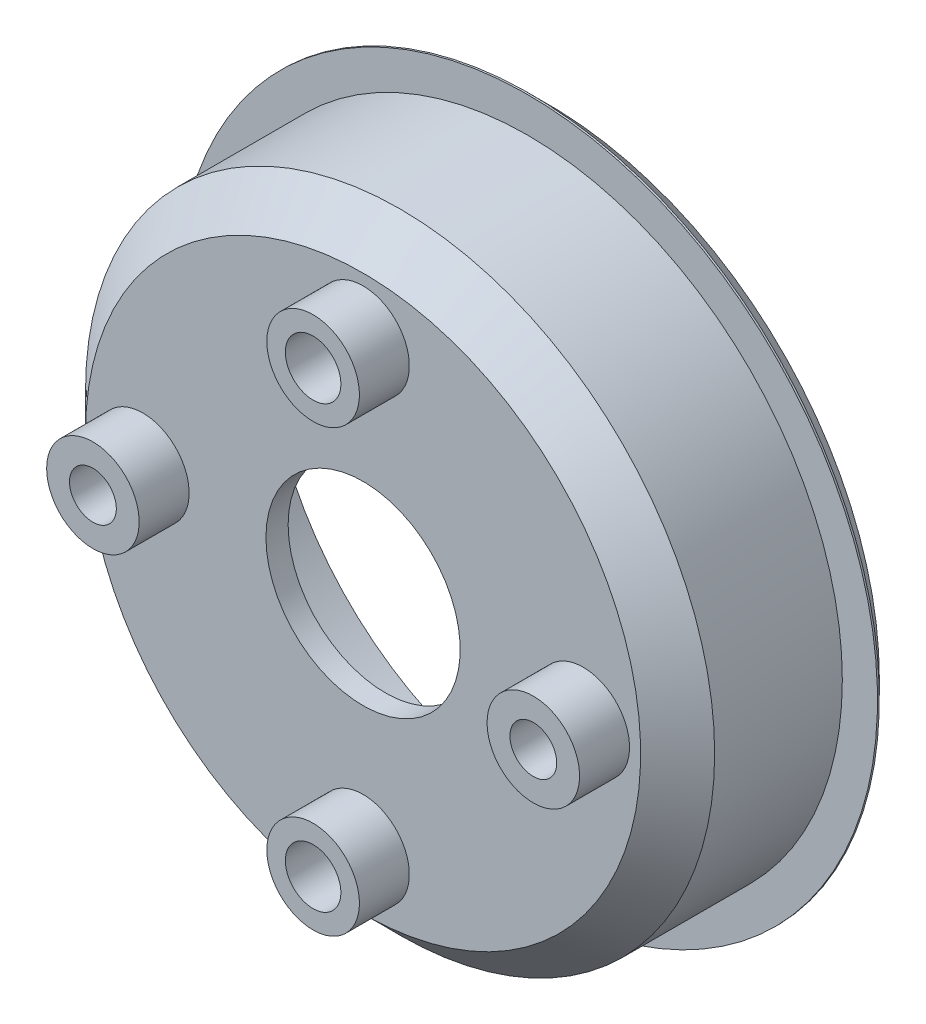
ISO-10303-21;
HEADER;
FILE_DESCRIPTION(('STEP AP214'),'2;1');
FILE_NAME('part.step','',(''),(''),'','','');
FILE_SCHEMA(('AUTOMOTIVE_DESIGN { 1 0 10303 214 1 1 1 1 }'));
ENDSEC;
DATA;
#1=APPLICATION_CONTEXT('core data for automotive mechanical design processes');
#2=APPLICATION_PROTOCOL_DEFINITION('international standard','automotive_design',2000,#1);
#3=PRODUCT_CONTEXT('',#1,'mechanical');
#4=PRODUCT('Part','Part','',(#3));
#5=PRODUCT_RELATED_PRODUCT_CATEGORY('part','',(#4));
#6=PRODUCT_DEFINITION_FORMATION('','',#4);
#7=PRODUCT_DEFINITION_CONTEXT('part definition',#1,'design');
#8=PRODUCT_DEFINITION('design','',#6,#7);
#9=PRODUCT_DEFINITION_SHAPE('','',#8);
#10=(LENGTH_UNIT() NAMED_UNIT(*) SI_UNIT(.MILLI.,.METRE.));
#11=(NAMED_UNIT(*) PLANE_ANGLE_UNIT() SI_UNIT($,.RADIAN.));
#12=(NAMED_UNIT(*) SI_UNIT($,.STERADIAN.) SOLID_ANGLE_UNIT());
#13=UNCERTAINTY_MEASURE_WITH_UNIT(LENGTH_MEASURE(1.E-05),#10,'distance_accuracy_value','');
#14=(GEOMETRIC_REPRESENTATION_CONTEXT(3) GLOBAL_UNCERTAINTY_ASSIGNED_CONTEXT((#13)) GLOBAL_UNIT_ASSIGNED_CONTEXT((#10,
#11,#12)) REPRESENTATION_CONTEXT('',''));
#15=CARTESIAN_POINT('',(0.,0.,0.));
#16=DIRECTION('',(0.,0.,1.));
#17=DIRECTION('',(1.,0.,0.));
#18=AXIS2_PLACEMENT_3D('',#15,#16,#17);
#19=CARTESIAN_POINT('',(0.,0.,1.1));
#20=DIRECTION('',(0.,0.,1.));
#21=DIRECTION('',(1.,0.,0.));
#22=AXIS2_PLACEMENT_3D('',#19,#20,#21);
#23=PLANE('',#22);
#24=CARTESIAN_POINT('',(0.,0.,1.1));
#25=DIRECTION('',(0.,0.,-1.));
#26=DIRECTION('',(1.,0.,0.));
#27=AXIS2_PLACEMENT_3D('',#24,#25,#26);
#28=CIRCLE('',#27,17.);
#29=CARTESIAN_POINT('',(-17.,0.,1.1));
#30=VERTEX_POINT('',#29);
#31=EDGE_CURVE('E238',#30,#30,#28,.T.);
#32=ORIENTED_EDGE('',*,*,#31,.T.);
#33=EDGE_LOOP('',(#32));
#34=FACE_BOUND('',#33,.T.);
#35=CARTESIAN_POINT('',(0.,0.,1.1));
#36=DIRECTION('',(0.,0.,1.));
#37=DIRECTION('',(1.,0.,0.));
#38=AXIS2_PLACEMENT_3D('',#35,#36,#37);
#39=CIRCLE('',#38,18.9);
#40=CARTESIAN_POINT('',(-18.9,0.,1.1));
#41=VERTEX_POINT('',#40);
#42=EDGE_CURVE('E224',#41,#41,#39,.T.);
#43=ORIENTED_EDGE('',*,*,#42,.T.);
#44=EDGE_LOOP('',(#43));
#45=FACE_BOUND('',#44,.T.);
#46=ADVANCED_FACE('F16',(#34,#45),#23,.T.);
#47=CARTESIAN_POINT('',(0.,0.,10.));
#48=DIRECTION('',(0.,0.,1.));
#49=DIRECTION('',(1.,0.,0.));
#50=AXIS2_PLACEMENT_3D('',#47,#48,#49);
#51=PLANE('',#50);
#52=CARTESIAN_POINT('',(0.,-11.9,10.));
#53=DIRECTION('',(0.,0.,1.));
#54=DIRECTION('',(1.,0.,0.));
#55=AXIS2_PLACEMENT_3D('',#52,#53,#54);
#56=CIRCLE('',#55,1.5);
#57=CARTESIAN_POINT('',(-1.5,-11.9,10.));
#58=VERTEX_POINT('',#57);
#59=EDGE_CURVE('E256',#58,#58,#56,.T.);
#60=ORIENTED_EDGE('',*,*,#59,.T.);
#61=EDGE_LOOP('',(#60));
#62=FACE_BOUND('',#61,.T.);
#63=ADVANCED_FACE('F604',(#62),#51,.T.);
#64=CARTESIAN_POINT('',(-11.9,0.,0.));
#65=DIRECTION('',(0.,0.,1.));
#66=DIRECTION('',(1.,0.,0.));
#67=AXIS2_PLACEMENT_3D('',#64,#65,#66);
#68=CYLINDRICAL_SURFACE('',#67,1.2645);
#69=CARTESIAN_POINT('',(-11.9,0.,12.7));
#70=DIRECTION('',(0.,0.,-1.));
#71=DIRECTION('',(1.,0.,0.));
#72=AXIS2_PLACEMENT_3D('',#69,#70,#71);
#73=CIRCLE('',#72,1.2645);
#74=CARTESIAN_POINT('',(-13.1645,0.,12.7));
#75=VERTEX_POINT('',#74);
#76=EDGE_CURVE('E193',#75,#75,#73,.T.);
#77=ORIENTED_EDGE('',*,*,#76,.F.);
#78=DIRECTION('',(0.,0.,-1.));
#79=VECTOR('',#78,1.);
#80=CARTESIAN_POINT('',(-13.1645,0.,0.));
#81=LINE('',#80,#79);
#82=CARTESIAN_POINT('',(-13.1645,0.,7.8));
#83=VERTEX_POINT('',#82);
#84=EDGE_CURVE('E11',#75,#83,#81,.T.);
#85=ORIENTED_EDGE('',*,*,#84,.T.);
#86=CARTESIAN_POINT('',(-11.9,0.,7.8));
#87=DIRECTION('',(0.,0.,-1.));
#88=DIRECTION('',(1.,0.,0.));
#89=AXIS2_PLACEMENT_3D('',#86,#87,#88);
#90=CIRCLE('',#89,1.2645);
#91=EDGE_CURVE('E195',#83,#83,#90,.T.);
#92=ORIENTED_EDGE('',*,*,#91,.T.);
#93=ORIENTED_EDGE('',*,*,#84,.F.);
#94=EDGE_LOOP('',(#77,#85,#92,#93));
#95=FACE_BOUND('',#94,.T.);
#96=ADVANCED_FACE('F192',(#95),#68,.F.);
#97=CARTESIAN_POINT('',(11.9,0.,0.));
#98=DIRECTION('',(0.,0.,1.));
#99=DIRECTION('',(1.,0.,0.));
#100=AXIS2_PLACEMENT_3D('',#97,#98,#99);
#101=CYLINDRICAL_SURFACE('',#100,1.2645);
#102=CARTESIAN_POINT('',(11.9,0.,12.7));
#103=DIRECTION('',(0.,0.,-1.));
#104=DIRECTION('',(1.,0.,0.));
#105=AXIS2_PLACEMENT_3D('',#102,#103,#104);
#106=CIRCLE('',#105,1.2645);
#107=CARTESIAN_POINT('',(10.6355,0.,12.7));
#108=VERTEX_POINT('',#107);
#109=EDGE_CURVE('E215',#108,#108,#106,.T.);
#110=ORIENTED_EDGE('',*,*,#109,.F.);
#111=DIRECTION('',(0.,0.,-1.));
#112=VECTOR('',#111,1.);
#113=CARTESIAN_POINT('',(10.6355,0.,0.));
#114=LINE('',#113,#112);
#115=CARTESIAN_POINT('',(10.6355,0.,7.8));
#116=VERTEX_POINT('',#115);
#117=EDGE_CURVE('E27',#108,#116,#114,.T.);
#118=ORIENTED_EDGE('',*,*,#117,.T.);
#119=CARTESIAN_POINT('',(11.9,0.,7.8));
#120=DIRECTION('',(0.,0.,-1.));
#121=DIRECTION('',(1.,0.,0.));
#122=AXIS2_PLACEMENT_3D('',#119,#120,#121);
#123=CIRCLE('',#122,1.2645);
#124=EDGE_CURVE('E287',#116,#116,#123,.T.);
#125=ORIENTED_EDGE('',*,*,#124,.T.);
#126=ORIENTED_EDGE('',*,*,#117,.F.);
#127=EDGE_LOOP('',(#110,#118,#125,#126));
#128=FACE_BOUND('',#127,.T.);
#129=ADVANCED_FACE('F588',(#128),#101,.F.);
#130=CARTESIAN_POINT('',(0.,0.,0.));
#131=DIRECTION('',(0.,0.,1.));
#132=DIRECTION('',(1.,0.,0.));
#133=AXIS2_PLACEMENT_3D('',#130,#131,#132);
#134=CYLINDRICAL_SURFACE('',#133,5.25);
#135=CARTESIAN_POINT('',(0.,0.,10.));
#136=DIRECTION('',(0.,0.,-1.));
#137=DIRECTION('',(1.,0.,0.));
#138=AXIS2_PLACEMENT_3D('',#135,#136,#137);
#139=CIRCLE('',#138,5.25);
#140=CARTESIAN_POINT('',(-5.25,0.,10.));
#141=VERTEX_POINT('',#140);
#142=EDGE_CURVE('E216',#141,#141,#139,.T.);
#143=ORIENTED_EDGE('',*,*,#142,.F.);
#144=DIRECTION('',(0.,0.,-1.));
#145=VECTOR('',#144,1.);
#146=CARTESIAN_POINT('',(-5.25,0.,0.));
#147=LINE('',#146,#145);
#148=CARTESIAN_POINT('',(-5.25,0.,8.8));
#149=VERTEX_POINT('',#148);
#150=EDGE_CURVE('E176',#141,#149,#147,.T.);
#151=ORIENTED_EDGE('',*,*,#150,.T.);
#152=CARTESIAN_POINT('',(0.,0.,8.8));
#153=DIRECTION('',(0.,0.,-1.));
#154=DIRECTION('',(1.,0.,0.));
#155=AXIS2_PLACEMENT_3D('',#152,#153,#154);
#156=CIRCLE('',#155,5.25);
#157=EDGE_CURVE('E253',#149,#149,#156,.T.);
#158=ORIENTED_EDGE('',*,*,#157,.T.);
#159=ORIENTED_EDGE('',*,*,#150,.F.);
#160=EDGE_LOOP('',(#143,#151,#158,#159));
#161=FACE_BOUND('',#160,.T.);
#162=ADVANCED_FACE('F578',(#161),#134,.F.);
#163=CARTESIAN_POINT('',(0.,0.,7.8));
#164=DIRECTION('',(0.,0.,1.));
#165=DIRECTION('',(1.,0.,0.));
#166=AXIS2_PLACEMENT_3D('',#163,#164,#165);
#167=PLANE('',#166);
#168=ORIENTED_EDGE('',*,*,#91,.F.);
#169=EDGE_LOOP('',(#168));
#170=FACE_BOUND('',#169,.T.);
#171=ORIENTED_EDGE('',*,*,#124,.F.);
#172=EDGE_LOOP('',(#171));
#173=FACE_BOUND('',#172,.T.);
#174=CARTESIAN_POINT('',(0.,0.,7.8));
#175=DIRECTION('',(0.,0.,1.));
#176=DIRECTION('',(1.,0.,0.));
#177=AXIS2_PLACEMENT_3D('',#174,#175,#176);
#178=CIRCLE('',#177,8.25);
#179=CARTESIAN_POINT('',(-8.25,0.,7.8));
#180=VERTEX_POINT('',#179);
#181=EDGE_CURVE('E233',#180,#180,#178,.T.);
#182=ORIENTED_EDGE('',*,*,#181,.T.);
#183=EDGE_LOOP('',(#182));
#184=FACE_BOUND('',#183,.T.);
#185=CARTESIAN_POINT('',(0.,0.,7.8));
#186=DIRECTION('',(0.,0.,1.));
#187=DIRECTION('',(1.,0.,0.));
#188=AXIS2_PLACEMENT_3D('',#185,#186,#187);
#189=CIRCLE('',#188,15.25);
#190=CARTESIAN_POINT('',(-15.25,0.,7.8));
#191=VERTEX_POINT('',#190);
#192=EDGE_CURVE('E77',#191,#191,#189,.T.);
#193=ORIENTED_EDGE('',*,*,#192,.F.);
#194=EDGE_LOOP('',(#193));
#195=FACE_BOUND('',#194,.T.);
#196=ADVANCED_FACE('F570',(#170,#173,#184,#195),#167,.F.);
#197=CARTESIAN_POINT('',(0.,0.,0.));
#198=DIRECTION('',(0.,0.,1.));
#199=DIRECTION('',(1.,0.,0.));
#200=AXIS2_PLACEMENT_3D('',#197,#198,#199);
#201=CYLINDRICAL_SURFACE('',#200,15.25);
#202=CARTESIAN_POINT('',(0.,0.,0.));
#203=DIRECTION('',(0.,0.,1.));
#204=DIRECTION('',(1.,0.,0.));
#205=AXIS2_PLACEMENT_3D('',#202,#203,#204);
#206=CIRCLE('',#205,15.25);
#207=CARTESIAN_POINT('',(-15.25,0.,0.));
#208=VERTEX_POINT('',#207);
#209=EDGE_CURVE('E223',#208,#208,#206,.T.);
#210=ORIENTED_EDGE('',*,*,#209,.F.);
#211=DIRECTION('',(0.,0.,1.));
#212=VECTOR('',#211,1.);
#213=CARTESIAN_POINT('',(-15.25,0.,0.));
#214=LINE('',#213,#212);
#215=EDGE_CURVE('E288',#208,#191,#214,.T.);
#216=ORIENTED_EDGE('',*,*,#215,.T.);
#217=ORIENTED_EDGE('',*,*,#192,.T.);
#218=ORIENTED_EDGE('',*,*,#215,.F.);
#219=EDGE_LOOP('',(#210,#216,#217,#218));
#220=FACE_BOUND('',#219,.T.);
#221=ADVANCED_FACE('F18',(#220),#201,.F.);
#222=CARTESIAN_POINT('',(0.,0.,10.));
#223=DIRECTION('',(0.,0.,1.));
#224=DIRECTION('',(1.,0.,0.));
#225=AXIS2_PLACEMENT_3D('',#222,#223,#224);
#226=PLANE('',#225);
#227=CARTESIAN_POINT('',(0.,11.9,10.));
#228=DIRECTION('',(0.,0.,1.));
#229=DIRECTION('',(1.,0.,0.));
#230=AXIS2_PLACEMENT_3D('',#227,#228,#229);
#231=CIRCLE('',#230,1.5);
#232=CARTESIAN_POINT('',(-1.5,11.9,10.));
#233=VERTEX_POINT('',#232);
#234=EDGE_CURVE('E329',#233,#233,#231,.T.);
#235=ORIENTED_EDGE('',*,*,#234,.T.);
#236=EDGE_LOOP('',(#235));
#237=FACE_BOUND('',#236,.T.);
#238=ADVANCED_FACE('F551',(#237),#226,.T.);
#239=CARTESIAN_POINT('',(0.,0.,12.7));
#240=DIRECTION('',(0.,0.,1.));
#241=DIRECTION('',(1.,0.,0.));
#242=AXIS2_PLACEMENT_3D('',#239,#240,#241);
#243=PLANE('',#242);
#244=CARTESIAN_POINT('',(0.,-11.9,12.7));
#245=DIRECTION('',(0.,0.,-1.));
#246=DIRECTION('',(1.,0.,0.));
#247=AXIS2_PLACEMENT_3D('',#244,#245,#246);
#248=CIRCLE('',#247,1.5);
#249=CARTESIAN_POINT('',(-1.5,-11.9,12.7));
#250=VERTEX_POINT('',#249);
#251=EDGE_CURVE('E20',#250,#250,#248,.T.);
#252=ORIENTED_EDGE('',*,*,#251,.T.);
#253=EDGE_LOOP('',(#252));
#254=FACE_BOUND('',#253,.T.);
#255=CARTESIAN_POINT('',(0.,-11.9,12.7));
#256=DIRECTION('',(0.,0.,1.));
#257=DIRECTION('',(1.,0.,0.));
#258=AXIS2_PLACEMENT_3D('',#255,#256,#257);
#259=CIRCLE('',#258,2.5);
#260=CARTESIAN_POINT('',(-2.5,-11.9,12.7));
#261=VERTEX_POINT('',#260);
#262=EDGE_CURVE('E263',#261,#261,#259,.T.);
#263=ORIENTED_EDGE('',*,*,#262,.T.);
#264=EDGE_LOOP('',(#263));
#265=FACE_BOUND('',#264,.T.);
#266=ADVANCED_FACE('F542',(#254,#265),#243,.T.);
#267=CARTESIAN_POINT('',(0.,-11.9,10.));
#268=DIRECTION('',(0.,0.,1.));
#269=DIRECTION('',(1.,0.,0.));
#270=AXIS2_PLACEMENT_3D('',#267,#268,#269);
#271=CYLINDRICAL_SURFACE('',#270,2.5);
#272=ORIENTED_EDGE('',*,*,#262,.F.);
#273=DIRECTION('',(0.,0.,-1.));
#274=VECTOR('',#273,1.);
#275=CARTESIAN_POINT('',(-2.5,-11.9,10.));
#276=LINE('',#275,#274);
#277=CARTESIAN_POINT('',(-2.5,-11.9,10.));
#278=VERTEX_POINT('',#277);
#279=EDGE_CURVE('E87',#261,#278,#276,.T.);
#280=ORIENTED_EDGE('',*,*,#279,.T.);
#281=CARTESIAN_POINT('',(0.,-11.9,10.));
#282=DIRECTION('',(0.,0.,-1.));
#283=DIRECTION('',(1.,0.,0.));
#284=AXIS2_PLACEMENT_3D('',#281,#282,#283);
#285=CIRCLE('',#284,2.5);
#286=EDGE_CURVE('E219',#278,#278,#285,.T.);
#287=ORIENTED_EDGE('',*,*,#286,.F.);
#288=ORIENTED_EDGE('',*,*,#279,.F.);
#289=EDGE_LOOP('',(#272,#280,#287,#288));
#290=FACE_BOUND('',#289,.T.);
#291=ADVANCED_FACE('F532',(#290),#271,.T.);
#292=CARTESIAN_POINT('',(0.,-11.9,10.));
#293=DIRECTION('',(0.,0.,1.));
#294=DIRECTION('',(1.,0.,0.));
#295=AXIS2_PLACEMENT_3D('',#292,#293,#294);
#296=CYLINDRICAL_SURFACE('',#295,1.5);
#297=ORIENTED_EDGE('',*,*,#251,.F.);
#298=DIRECTION('',(0.,0.,-1.));
#299=VECTOR('',#298,1.);
#300=CARTESIAN_POINT('',(-1.5,-11.9,10.));
#301=LINE('',#300,#299);
#302=EDGE_CURVE('E207',#250,#58,#301,.T.);
#303=ORIENTED_EDGE('',*,*,#302,.T.);
#304=ORIENTED_EDGE('',*,*,#59,.F.);
#305=ORIENTED_EDGE('',*,*,#302,.F.);
#306=EDGE_LOOP('',(#297,#303,#304,#305));
#307=FACE_BOUND('',#306,.T.);
#308=ADVANCED_FACE('F523',(#307),#296,.F.);
#309=CARTESIAN_POINT('',(0.,0.,12.7));
#310=DIRECTION('',(0.,0.,1.));
#311=DIRECTION('',(1.,0.,0.));
#312=AXIS2_PLACEMENT_3D('',#309,#310,#311);
#313=PLANE('',#312);
#314=ORIENTED_EDGE('',*,*,#76,.T.);
#315=EDGE_LOOP('',(#314));
#316=FACE_BOUND('',#315,.T.);
#317=CARTESIAN_POINT('',(-11.9,0.,12.7));
#318=DIRECTION('',(0.,0.,1.));
#319=DIRECTION('',(1.,0.,0.));
#320=AXIS2_PLACEMENT_3D('',#317,#318,#319);
#321=CIRCLE('',#320,2.5);
#322=CARTESIAN_POINT('',(-14.4,0.,12.7));
#323=VERTEX_POINT('',#322);
#324=EDGE_CURVE('E208',#323,#323,#321,.T.);
#325=ORIENTED_EDGE('',*,*,#324,.T.);
#326=EDGE_LOOP('',(#325));
#327=FACE_BOUND('',#326,.T.);
#328=ADVANCED_FACE('F197',(#316,#327),#313,.T.);
#329=CARTESIAN_POINT('',(-11.9,0.,10.));
#330=DIRECTION('',(0.,0.,1.));
#331=DIRECTION('',(1.,0.,0.));
#332=AXIS2_PLACEMENT_3D('',#329,#330,#331);
#333=CYLINDRICAL_SURFACE('',#332,2.5);
#334=ORIENTED_EDGE('',*,*,#324,.F.);
#335=DIRECTION('',(0.,0.,-1.));
#336=VECTOR('',#335,1.);
#337=CARTESIAN_POINT('',(-14.4,0.,10.));
#338=LINE('',#337,#336);
#339=CARTESIAN_POINT('',(-14.4,0.,10.));
#340=VERTEX_POINT('',#339);
#341=EDGE_CURVE('E164',#323,#340,#338,.T.);
#342=ORIENTED_EDGE('',*,*,#341,.T.);
#343=CARTESIAN_POINT('',(-11.9,0.,10.));
#344=DIRECTION('',(0.,0.,-1.));
#345=DIRECTION('',(1.,0.,0.));
#346=AXIS2_PLACEMENT_3D('',#343,#344,#345);
#347=CIRCLE('',#346,2.5);
#348=EDGE_CURVE('E220',#340,#340,#347,.T.);
#349=ORIENTED_EDGE('',*,*,#348,.F.);
#350=ORIENTED_EDGE('',*,*,#341,.F.);
#351=EDGE_LOOP('',(#334,#342,#349,#350));
#352=FACE_BOUND('',#351,.T.);
#353=ADVANCED_FACE('F505',(#352),#333,.T.);
#354=CARTESIAN_POINT('',(0.,0.,12.7));
#355=DIRECTION('',(0.,0.,1.));
#356=DIRECTION('',(1.,0.,0.));
#357=AXIS2_PLACEMENT_3D('',#354,#355,#356);
#358=PLANE('',#357);
#359=ORIENTED_EDGE('',*,*,#109,.T.);
#360=EDGE_LOOP('',(#359));
#361=FACE_BOUND('',#360,.T.);
#362=CARTESIAN_POINT('',(11.9,0.,12.7));
#363=DIRECTION('',(0.,0.,1.));
#364=DIRECTION('',(1.,0.,0.));
#365=AXIS2_PLACEMENT_3D('',#362,#363,#364);
#366=CIRCLE('',#365,2.5);
#367=CARTESIAN_POINT('',(9.4,0.,12.7));
#368=VERTEX_POINT('',#367);
#369=EDGE_CURVE('E282',#368,#368,#366,.T.);
#370=ORIENTED_EDGE('',*,*,#369,.T.);
#371=EDGE_LOOP('',(#370));
#372=FACE_BOUND('',#371,.T.);
#373=ADVANCED_FACE('F495',(#361,#372),#358,.T.);
#374=CARTESIAN_POINT('',(11.9,0.,10.));
#375=DIRECTION('',(0.,0.,1.));
#376=DIRECTION('',(1.,0.,0.));
#377=AXIS2_PLACEMENT_3D('',#374,#375,#376);
#378=CYLINDRICAL_SURFACE('',#377,2.5);
#379=ORIENTED_EDGE('',*,*,#369,.F.);
#380=DIRECTION('',(0.,0.,-1.));
#381=VECTOR('',#380,1.);
#382=CARTESIAN_POINT('',(9.4,0.,10.));
#383=LINE('',#382,#381);
#384=CARTESIAN_POINT('',(9.4,0.,10.));
#385=VERTEX_POINT('',#384);
#386=EDGE_CURVE('E141',#368,#385,#383,.T.);
#387=ORIENTED_EDGE('',*,*,#386,.T.);
#388=CARTESIAN_POINT('',(11.9,0.,10.));
#389=DIRECTION('',(0.,0.,-1.));
#390=DIRECTION('',(1.,0.,0.));
#391=AXIS2_PLACEMENT_3D('',#388,#389,#390);
#392=CIRCLE('',#391,2.5);
#393=EDGE_CURVE('E241',#385,#385,#392,.T.);
#394=ORIENTED_EDGE('',*,*,#393,.F.);
#395=ORIENTED_EDGE('',*,*,#386,.F.);
#396=EDGE_LOOP('',(#379,#387,#394,#395));
#397=FACE_BOUND('',#396,.T.);
#398=ADVANCED_FACE('F484',(#397),#378,.T.);
#399=CARTESIAN_POINT('',(0.,0.,12.7));
#400=DIRECTION('',(0.,0.,1.));
#401=DIRECTION('',(1.,0.,0.));
#402=AXIS2_PLACEMENT_3D('',#399,#400,#401);
#403=PLANE('',#402);
#404=CARTESIAN_POINT('',(0.,11.9,12.7));
#405=DIRECTION('',(0.,0.,-1.));
#406=DIRECTION('',(1.,0.,0.));
#407=AXIS2_PLACEMENT_3D('',#404,#405,#406);
#408=CIRCLE('',#407,1.5);
#409=CARTESIAN_POINT('',(-1.5,11.9,12.7));
#410=VERTEX_POINT('',#409);
#411=EDGE_CURVE('E248',#410,#410,#408,.T.);
#412=ORIENTED_EDGE('',*,*,#411,.T.);
#413=EDGE_LOOP('',(#412));
#414=FACE_BOUND('',#413,.T.);
#415=CARTESIAN_POINT('',(0.,11.9,12.7));
#416=DIRECTION('',(0.,0.,1.));
#417=DIRECTION('',(1.,0.,0.));
#418=AXIS2_PLACEMENT_3D('',#415,#416,#417);
#419=CIRCLE('',#418,2.5);
#420=CARTESIAN_POINT('',(-2.5,11.9,12.7));
#421=VERTEX_POINT('',#420);
#422=EDGE_CURVE('E303',#421,#421,#419,.T.);
#423=ORIENTED_EDGE('',*,*,#422,.T.);
#424=EDGE_LOOP('',(#423));
#425=FACE_BOUND('',#424,.T.);
#426=ADVANCED_FACE('F473',(#414,#425),#403,.T.);
#427=CARTESIAN_POINT('',(0.,11.9,10.));
#428=DIRECTION('',(0.,0.,1.));
#429=DIRECTION('',(1.,0.,0.));
#430=AXIS2_PLACEMENT_3D('',#427,#428,#429);
#431=CYLINDRICAL_SURFACE('',#430,2.5);
#432=ORIENTED_EDGE('',*,*,#422,.F.);
#433=DIRECTION('',(0.,0.,-1.));
#434=VECTOR('',#433,1.);
#435=CARTESIAN_POINT('',(-2.5,11.9,10.));
#436=LINE('',#435,#434);
#437=CARTESIAN_POINT('',(-2.5,11.9,10.));
#438=VERTEX_POINT('',#437);
#439=EDGE_CURVE('E153',#421,#438,#436,.T.);
#440=ORIENTED_EDGE('',*,*,#439,.T.);
#441=CARTESIAN_POINT('',(0.,11.9,10.));
#442=DIRECTION('',(0.,0.,-1.));
#443=DIRECTION('',(1.,0.,0.));
#444=AXIS2_PLACEMENT_3D('',#441,#442,#443);
#445=CIRCLE('',#444,2.5);
#446=EDGE_CURVE('E229',#438,#438,#445,.T.);
#447=ORIENTED_EDGE('',*,*,#446,.F.);
#448=ORIENTED_EDGE('',*,*,#439,.F.);
#449=EDGE_LOOP('',(#432,#440,#447,#448));
#450=FACE_BOUND('',#449,.T.);
#451=ADVANCED_FACE('F461',(#450),#431,.T.);
#452=CARTESIAN_POINT('',(0.,11.9,10.));
#453=DIRECTION('',(0.,0.,1.));
#454=DIRECTION('',(1.,0.,0.));
#455=AXIS2_PLACEMENT_3D('',#452,#453,#454);
#456=CYLINDRICAL_SURFACE('',#455,1.5);
#457=ORIENTED_EDGE('',*,*,#411,.F.);
#458=DIRECTION('',(0.,0.,-1.));
#459=VECTOR('',#458,1.);
#460=CARTESIAN_POINT('',(-1.5,11.9,10.));
#461=LINE('',#460,#459);
#462=EDGE_CURVE('E252',#410,#233,#461,.T.);
#463=ORIENTED_EDGE('',*,*,#462,.T.);
#464=ORIENTED_EDGE('',*,*,#234,.F.);
#465=ORIENTED_EDGE('',*,*,#462,.F.);
#466=EDGE_LOOP('',(#457,#463,#464,#465));
#467=FACE_BOUND('',#466,.T.);
#468=ADVANCED_FACE('F450',(#467),#456,.F.);
#469=CARTESIAN_POINT('',(0.,0.,8.8));
#470=DIRECTION('',(0.,0.,-1.));
#471=DIRECTION('',(0.,-1.,0.));
#472=AXIS2_PLACEMENT_3D('',#469,#470,#471);
#473=PLANE('',#472);
#474=ORIENTED_EDGE('',*,*,#157,.F.);
#475=EDGE_LOOP('',(#474));
#476=FACE_BOUND('',#475,.T.);
#477=CARTESIAN_POINT('',(0.,0.,8.8));
#478=DIRECTION('',(0.,0.,1.));
#479=DIRECTION('',(1.,0.,0.));
#480=AXIS2_PLACEMENT_3D('',#477,#478,#479);
#481=CIRCLE('',#480,8.25);
#482=CARTESIAN_POINT('',(-8.25,0.,8.8));
#483=VERTEX_POINT('',#482);
#484=EDGE_CURVE('E211',#483,#483,#481,.T.);
#485=ORIENTED_EDGE('',*,*,#484,.F.);
#486=EDGE_LOOP('',(#485));
#487=FACE_BOUND('',#486,.T.);
#488=ADVANCED_FACE('F439',(#476,#487),#473,.T.);
#489=CARTESIAN_POINT('',(0.,0.,7.8));
#490=DIRECTION('',(0.,0.,1.));
#491=DIRECTION('',(1.,0.,0.));
#492=AXIS2_PLACEMENT_3D('',#489,#490,#491);
#493=CYLINDRICAL_SURFACE('',#492,8.25);
#494=ORIENTED_EDGE('',*,*,#181,.F.);
#495=DIRECTION('',(0.,0.,1.));
#496=VECTOR('',#495,1.);
#497=CARTESIAN_POINT('',(-8.25,0.,7.8));
#498=LINE('',#497,#496);
#499=EDGE_CURVE('E237',#180,#483,#498,.T.);
#500=ORIENTED_EDGE('',*,*,#499,.T.);
#501=ORIENTED_EDGE('',*,*,#484,.T.);
#502=ORIENTED_EDGE('',*,*,#499,.F.);
#503=EDGE_LOOP('',(#494,#500,#501,#502));
#504=FACE_BOUND('',#503,.T.);
#505=ADVANCED_FACE('F427',(#504),#493,.F.);
#506=CARTESIAN_POINT('',(0.,0.,0.));
#507=DIRECTION('',(0.,0.,1.));
#508=DIRECTION('',(1.,0.,0.));
#509=AXIS2_PLACEMENT_3D('',#506,#507,#508);
#510=CYLINDRICAL_SURFACE('',#509,17.);
#511=CARTESIAN_POINT('',(0.,0.,8.));
#512=DIRECTION('',(0.,0.,1.));
#513=DIRECTION('',(1.,0.,0.));
#514=AXIS2_PLACEMENT_3D('',#511,#512,#513);
#515=CIRCLE('',#514,17.);
#516=CARTESIAN_POINT('',(-17.,0.,8.));
#517=VERTEX_POINT('',#516);
#518=EDGE_CURVE('E225',#517,#517,#515,.T.);
#519=ORIENTED_EDGE('',*,*,#518,.F.);
#520=DIRECTION('',(0.,0.,-1.));
#521=VECTOR('',#520,1.);
#522=CARTESIAN_POINT('',(-17.,0.,0.));
#523=LINE('',#522,#521);
#524=EDGE_CURVE('E272',#517,#30,#523,.T.);
#525=ORIENTED_EDGE('',*,*,#524,.T.);
#526=ORIENTED_EDGE('',*,*,#31,.F.);
#527=ORIENTED_EDGE('',*,*,#524,.F.);
#528=EDGE_LOOP('',(#519,#525,#526,#527));
#529=FACE_BOUND('',#528,.T.);
#530=ADVANCED_FACE('F415',(#529),#510,.T.);
#531=CARTESIAN_POINT('',(0.,0.,10.));
#532=DIRECTION('',(0.,0.,1.));
#533=DIRECTION('',(1.,0.,0.));
#534=AXIS2_PLACEMENT_3D('',#531,#532,#533);
#535=PLANE('',#534);
#536=ORIENTED_EDGE('',*,*,#286,.T.);
#537=EDGE_LOOP('',(#536));
#538=FACE_BOUND('',#537,.T.);
#539=ORIENTED_EDGE('',*,*,#142,.T.);
#540=EDGE_LOOP('',(#539));
#541=FACE_BOUND('',#540,.T.);
#542=ORIENTED_EDGE('',*,*,#348,.T.);
#543=EDGE_LOOP('',(#542));
#544=FACE_BOUND('',#543,.T.);
#545=ORIENTED_EDGE('',*,*,#393,.T.);
#546=EDGE_LOOP('',(#545));
#547=FACE_BOUND('',#546,.T.);
#548=ORIENTED_EDGE('',*,*,#446,.T.);
#549=EDGE_LOOP('',(#548));
#550=FACE_BOUND('',#549,.T.);
#551=CARTESIAN_POINT('',(0.,0.,10.));
#552=DIRECTION('',(0.,0.,-1.));
#553=DIRECTION('',(1.,0.,0.));
#554=AXIS2_PLACEMENT_3D('',#551,#552,#553);
#555=CIRCLE('',#554,15.);
#556=CARTESIAN_POINT('',(-15.,0.,10.));
#557=VERTEX_POINT('',#556);
#558=EDGE_CURVE('E318',#557,#557,#555,.T.);
#559=ORIENTED_EDGE('',*,*,#558,.F.);
#560=EDGE_LOOP('',(#559));
#561=FACE_BOUND('',#560,.T.);
#562=ADVANCED_FACE('F403',(#538,#541,#544,#547,#550,#561),#535,.T.);
#563=CARTESIAN_POINT('',(0.,0.,9.));
#564=DIRECTION('',(0.,0.,-1.));
#565=DIRECTION('',(1.,0.,0.));
#566=AXIS2_PLACEMENT_3D('',#563,#564,#565);
#567=CONICAL_SURFACE('',#566,16.,0.785398163397448);
#568=ORIENTED_EDGE('',*,*,#558,.T.);
#569=DIRECTION('',(-0.707106781186548,0.,-0.707106781186548));
#570=VECTOR('',#569,1.);
#571=CARTESIAN_POINT('',(-16.,0.,9.));
#572=LINE('',#571,#570);
#573=EDGE_CURVE('E230',#557,#517,#572,.T.);
#574=ORIENTED_EDGE('',*,*,#573,.T.);
#575=ORIENTED_EDGE('',*,*,#518,.T.);
#576=ORIENTED_EDGE('',*,*,#573,.F.);
#577=EDGE_LOOP('',(#568,#574,#575,#576));
#578=FACE_BOUND('',#577,.T.);
#579=ADVANCED_FACE('F390',(#578),#567,.T.);
#580=CARTESIAN_POINT('',(0.,0.,0.));
#581=DIRECTION('',(0.,0.,1.));
#582=DIRECTION('',(1.,0.,0.));
#583=AXIS2_PLACEMENT_3D('',#580,#581,#582);
#584=PLANE('',#583);
#585=ORIENTED_EDGE('',*,*,#209,.T.);
#586=EDGE_LOOP('',(#585));
#587=FACE_BOUND('',#586,.T.);
#588=CARTESIAN_POINT('',(0.,0.,0.));
#589=DIRECTION('',(0.,0.,1.));
#590=DIRECTION('',(1.,0.,0.));
#591=AXIS2_PLACEMENT_3D('',#588,#589,#590);
#592=CIRCLE('',#591,17.9);
#593=CARTESIAN_POINT('',(-17.9,0.,0.));
#594=VERTEX_POINT('',#593);
#595=EDGE_CURVE('E124',#594,#594,#592,.T.);
#596=ORIENTED_EDGE('',*,*,#595,.F.);
#597=EDGE_LOOP('',(#596));
#598=FACE_BOUND('',#597,.T.);
#599=ADVANCED_FACE('F378',(#587,#598),#584,.F.);
#600=CARTESIAN_POINT('',(0.,0.,0.));
#601=DIRECTION('',(0.,0.,1.));
#602=DIRECTION('',(1.,0.,0.));
#603=AXIS2_PLACEMENT_3D('',#600,#601,#602);
#604=CYLINDRICAL_SURFACE('',#603,18.9);
#605=ORIENTED_EDGE('',*,*,#42,.F.);
#606=DIRECTION('',(0.,0.,-1.));
#607=VECTOR('',#606,1.);
#608=CARTESIAN_POINT('',(-18.9,0.,0.));
#609=LINE('',#608,#607);
#610=CARTESIAN_POINT('',(-18.9,0.,1.));
#611=VERTEX_POINT('',#610);
#612=EDGE_CURVE('E114',#41,#611,#609,.T.);
#613=ORIENTED_EDGE('',*,*,#612,.T.);
#614=CARTESIAN_POINT('',(0.,0.,1.));
#615=DIRECTION('',(0.,0.,-1.));
#616=DIRECTION('',(1.,0.,0.));
#617=AXIS2_PLACEMENT_3D('',#614,#615,#616);
#618=CIRCLE('',#617,18.9);
#619=EDGE_CURVE('E304',#611,#611,#618,.T.);
#620=ORIENTED_EDGE('',*,*,#619,.F.);
#621=ORIENTED_EDGE('',*,*,#612,.F.);
#622=EDGE_LOOP('',(#605,#613,#620,#621));
#623=FACE_BOUND('',#622,.T.);
#624=ADVANCED_FACE('F365',(#623),#604,.T.);
#625=CARTESIAN_POINT('',(0.,0.,0.5));
#626=DIRECTION('',(0.,0.,1.));
#627=DIRECTION('',(1.,0.,0.));
#628=AXIS2_PLACEMENT_3D('',#625,#626,#627);
#629=CONICAL_SURFACE('',#628,18.4,0.785398163397449);
#630=ORIENTED_EDGE('',*,*,#619,.T.);
#631=DIRECTION('',(0.707106781186548,0.,-0.707106781186547));
#632=VECTOR('',#631,1.);
#633=CARTESIAN_POINT('',(-18.4,0.,0.5));
#634=LINE('',#633,#632);
#635=EDGE_CURVE('E291',#611,#594,#634,.T.);
#636=ORIENTED_EDGE('',*,*,#635,.T.);
#637=ORIENTED_EDGE('',*,*,#595,.T.);
#638=ORIENTED_EDGE('',*,*,#635,.F.);
#639=EDGE_LOOP('',(#630,#636,#637,#638));
#640=FACE_BOUND('',#639,.T.);
#641=ADVANCED_FACE('F359',(#640),#629,.T.);
#642=CLOSED_SHELL('',(#46,#63,#96,#129,#162,#196,#221,#238,#266,#291,#308,#328,#353,#373,#398,
#426,#451,#468,#488,#505,#530,#562,#579,#599,#624,#641));
#643=MANIFOLD_SOLID_BREP('B1',#642);
#644=ADVANCED_BREP_SHAPE_REPRESENTATION('',(#18,#643),#14);
#645=SHAPE_DEFINITION_REPRESENTATION(#9,#644);
ENDSEC;
END-ISO-10303-21;
